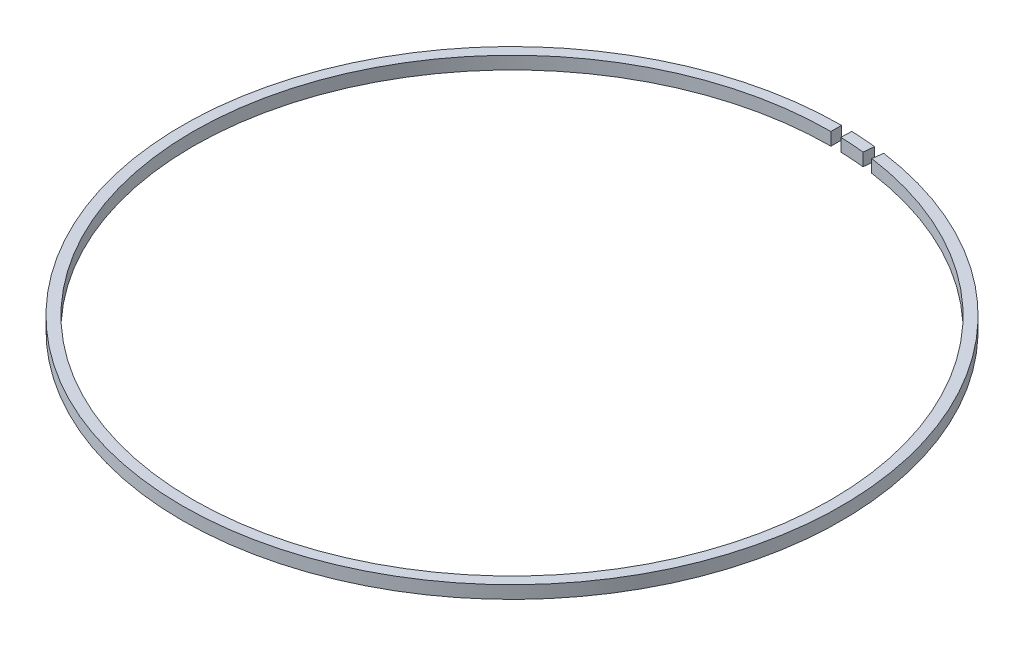
ISO-10303-21;
HEADER;
FILE_DESCRIPTION(('STEP AP214'),'2;1');
FILE_NAME('part.step','',(''),(''),'','','');
FILE_SCHEMA(('AUTOMOTIVE_DESIGN { 1 0 10303 214 1 1 1 1 }'));
ENDSEC;
DATA;
#1=APPLICATION_CONTEXT('core data for automotive mechanical design processes');
#2=APPLICATION_PROTOCOL_DEFINITION('international standard','automotive_design',2000,#1);
#3=PRODUCT_CONTEXT('',#1,'mechanical');
#4=PRODUCT('Part','Part','',(#3));
#5=PRODUCT_RELATED_PRODUCT_CATEGORY('part','',(#4));
#6=PRODUCT_DEFINITION_FORMATION('','',#4);
#7=PRODUCT_DEFINITION_CONTEXT('part definition',#1,'design');
#8=PRODUCT_DEFINITION('design','',#6,#7);
#9=PRODUCT_DEFINITION_SHAPE('','',#8);
#10=(LENGTH_UNIT() NAMED_UNIT(*) SI_UNIT(.MILLI.,.METRE.));
#11=(NAMED_UNIT(*) PLANE_ANGLE_UNIT() SI_UNIT($,.RADIAN.));
#12=(NAMED_UNIT(*) SI_UNIT($,.STERADIAN.) SOLID_ANGLE_UNIT());
#13=UNCERTAINTY_MEASURE_WITH_UNIT(LENGTH_MEASURE(1.E-05),#10,'distance_accuracy_value','');
#14=(GEOMETRIC_REPRESENTATION_CONTEXT(3) GLOBAL_UNCERTAINTY_ASSIGNED_CONTEXT((#13)) GLOBAL_UNIT_ASSIGNED_CONTEXT((#10,
#11,#12)) REPRESENTATION_CONTEXT('',''));
#15=CARTESIAN_POINT('',(0.,0.,0.));
#16=DIRECTION('',(0.,0.,1.));
#17=DIRECTION('',(1.,0.,0.));
#18=AXIS2_PLACEMENT_3D('',#15,#16,#17);
#19=CARTESIAN_POINT('',(0.,3.,0.));
#20=DIRECTION('',(0.,-1.,0.));
#21=DIRECTION('',(0.,0.,-1.));
#22=AXIS2_PLACEMENT_3D('',#19,#20,#21);
#23=CYLINDRICAL_SURFACE('',#22,77.5);
#24=CARTESIAN_POINT('',(0.,0.,0.));
#25=DIRECTION('',(0.,1.,0.));
#26=DIRECTION('',(0.,0.,1.));
#27=AXIS2_PLACEMENT_3D('',#24,#25,#26);
#28=CIRCLE('',#27,77.5);
#29=CARTESIAN_POINT('',(8.22728774385355,0.,-77.0620641845253));
#30=VERTEX_POINT('',#29);
#31=CARTESIAN_POINT('',(2.42944655623387,0.,-77.4619118627368));
#32=VERTEX_POINT('',#31);
#33=EDGE_CURVE('E97',#30,#32,#28,.T.);
#34=ORIENTED_EDGE('',*,*,#33,.T.);
#35=DIRECTION('',(0.,1.,0.));
#36=VECTOR('',#35,1.);
#37=CARTESIAN_POINT('',(2.42944655623387,0.,-77.4619118627368));
#38=LINE('',#37,#36);
#39=CARTESIAN_POINT('',(2.42944655623387,3.,-77.4619118627368));
#40=VERTEX_POINT('',#39);
#41=EDGE_CURVE('E105',#32,#40,#38,.T.);
#42=ORIENTED_EDGE('',*,*,#41,.T.);
#43=CARTESIAN_POINT('',(0.,3.,0.));
#44=DIRECTION('',(0.,1.,0.));
#45=DIRECTION('',(0.,0.,1.));
#46=AXIS2_PLACEMENT_3D('',#43,#44,#45);
#47=CIRCLE('',#46,77.5);
#48=CARTESIAN_POINT('',(8.22728774385352,3.,-77.0620641845251));
#49=VERTEX_POINT('',#48);
#50=EDGE_CURVE('E101',#49,#40,#47,.T.);
#51=ORIENTED_EDGE('',*,*,#50,.F.);
#52=DIRECTION('',(0.,1.,0.));
#53=VECTOR('',#52,1.);
#54=CARTESIAN_POINT('',(8.22728774385355,0.,-77.0620641845253));
#55=LINE('',#54,#53);
#56=EDGE_CURVE('E109',#30,#49,#55,.T.);
#57=ORIENTED_EDGE('',*,*,#56,.F.);
#58=EDGE_LOOP('',(#34,#42,#51,#57));
#59=FACE_BOUND('',#58,.T.);
#60=ADVANCED_FACE('F42',(#59),#23,.T.);
#61=CARTESIAN_POINT('',(0.,3.,0.));
#62=DIRECTION('',(0.,1.,0.));
#63=DIRECTION('',(0.,0.,1.));
#64=AXIS2_PLACEMENT_3D('',#61,#62,#63);
#65=PLANE('',#64);
#66=DIRECTION('',(0.0313476974997923,0.,-0.999508540164346));
#67=VECTOR('',#66,1.);
#68=CARTESIAN_POINT('',(2.42944655623388,3.,-77.4619118627368));
#69=LINE('',#68,#67);
#70=CARTESIAN_POINT('',(2.3510773124844,3.,-74.9631405123259));
#71=VERTEX_POINT('',#70);
#72=EDGE_CURVE('E46',#71,#40,#69,.T.);
#73=ORIENTED_EDGE('',*,*,#72,.F.);
#74=CARTESIAN_POINT('',(0.,3.,0.));
#75=DIRECTION('',(0.,1.,0.));
#76=DIRECTION('',(0.,0.,1.));
#77=AXIS2_PLACEMENT_3D('',#74,#75,#76);
#78=CIRCLE('',#77,75.);
#79=CARTESIAN_POINT('',(7.96189136501951,3.,-74.5761911463138));
#80=VERTEX_POINT('',#79);
#81=EDGE_CURVE('E88',#80,#71,#78,.T.);
#82=ORIENTED_EDGE('',*,*,#81,.F.);
#83=DIRECTION('',(-0.106158551533572,0.,0.994349215284195));
#84=VECTOR('',#83,1.);
#85=CARTESIAN_POINT('',(7.96189136501944,3.,-74.5761911463132));
#86=LINE('',#85,#84);
#87=EDGE_CURVE('E83',#49,#80,#86,.T.);
#88=ORIENTED_EDGE('',*,*,#87,.F.);
#89=ORIENTED_EDGE('',*,*,#50,.T.);
#90=EDGE_LOOP('',(#73,#82,#88,#89));
#91=FACE_BOUND('',#90,.T.);
#92=ADVANCED_FACE('F44',(#91),#65,.T.);
#93=CARTESIAN_POINT('',(0.,0.,0.));
#94=DIRECTION('',(0.,1.,0.));
#95=DIRECTION('',(0.,0.,1.));
#96=AXIS2_PLACEMENT_3D('',#93,#94,#95);
#97=PLANE('',#96);
#98=CARTESIAN_POINT('',(0.,0.,0.));
#99=DIRECTION('',(0.,1.,0.));
#100=DIRECTION('',(0.,0.,1.));
#101=AXIS2_PLACEMENT_3D('',#98,#99,#100);
#102=CIRCLE('',#101,75.);
#103=CARTESIAN_POINT('',(7.96189136501944,0.,-74.5761911463132));
#104=VERTEX_POINT('',#103);
#105=CARTESIAN_POINT('',(2.3510773124844,0.,-74.9631405123259));
#106=VERTEX_POINT('',#105);
#107=EDGE_CURVE('E95',#104,#106,#102,.T.);
#108=ORIENTED_EDGE('',*,*,#107,.T.);
#109=DIRECTION('',(0.0313476974997923,0.,-0.999508540164346));
#110=VECTOR('',#109,1.);
#111=CARTESIAN_POINT('',(2.42944655623388,0.,-77.4619118627368));
#112=LINE('',#111,#110);
#113=EDGE_CURVE('E98',#106,#32,#112,.T.);
#114=ORIENTED_EDGE('',*,*,#113,.T.);
#115=ORIENTED_EDGE('',*,*,#33,.F.);
#116=DIRECTION('',(-0.106158551533572,0.,0.994349215284195));
#117=VECTOR('',#116,1.);
#118=CARTESIAN_POINT('',(7.96189136501944,0.,-74.5761911463132));
#119=LINE('',#118,#117);
#120=EDGE_CURVE('E80',#30,#104,#119,.T.);
#121=ORIENTED_EDGE('',*,*,#120,.T.);
#122=EDGE_LOOP('',(#108,#114,#115,#121));
#123=FACE_BOUND('',#122,.T.);
#124=ADVANCED_FACE('F93',(#123),#97,.F.);
#125=CARTESIAN_POINT('',(0.,3.,0.));
#126=DIRECTION('',(0.,-1.,0.));
#127=DIRECTION('',(0.,0.,-1.));
#128=AXIS2_PLACEMENT_3D('',#125,#126,#127);
#129=CYLINDRICAL_SURFACE('',#128,75.);
#130=DIRECTION('',(0.,1.,0.));
#131=VECTOR('',#130,1.);
#132=CARTESIAN_POINT('',(2.3510773124844,0.,-74.9631405123259));
#133=LINE('',#132,#131);
#134=EDGE_CURVE('E12',#106,#71,#133,.T.);
#135=ORIENTED_EDGE('',*,*,#134,.F.);
#136=ORIENTED_EDGE('',*,*,#107,.F.);
#137=DIRECTION('',(0.,1.,0.));
#138=VECTOR('',#137,1.);
#139=CARTESIAN_POINT('',(7.96189136501944,0.,-74.5761911463132));
#140=LINE('',#139,#138);
#141=EDGE_CURVE('E77',#104,#80,#140,.T.);
#142=ORIENTED_EDGE('',*,*,#141,.T.);
#143=ORIENTED_EDGE('',*,*,#81,.T.);
#144=EDGE_LOOP('',(#135,#136,#142,#143));
#145=FACE_BOUND('',#144,.T.);
#146=ADVANCED_FACE('F100',(#145),#129,.F.);
#147=CARTESIAN_POINT('',(7.96189136501944,0.,-74.5761911463132));
#148=DIRECTION('',(-0.994349215284195,0.,-0.106158551533572));
#149=DIRECTION('',(-0.106158551533572,0.,0.994349215284195));
#150=AXIS2_PLACEMENT_3D('',#147,#148,#149);
#151=PLANE('',#150);
#152=ORIENTED_EDGE('',*,*,#87,.T.);
#153=ORIENTED_EDGE('',*,*,#141,.F.);
#154=ORIENTED_EDGE('',*,*,#120,.F.);
#155=ORIENTED_EDGE('',*,*,#56,.T.);
#156=EDGE_LOOP('',(#152,#153,#154,#155));
#157=FACE_BOUND('',#156,.T.);
#158=ADVANCED_FACE('F79',(#157),#151,.F.);
#159=CARTESIAN_POINT('',(2.42944655623388,0.,-77.4619118627368));
#160=DIRECTION('',(0.999508540164346,0.,0.0313476974997923));
#161=DIRECTION('',(0.0313476974997923,0.,-0.999508540164346));
#162=AXIS2_PLACEMENT_3D('',#159,#160,#161);
#163=PLANE('',#162);
#164=ORIENTED_EDGE('',*,*,#72,.T.);
#165=ORIENTED_EDGE('',*,*,#41,.F.);
#166=ORIENTED_EDGE('',*,*,#113,.F.);
#167=ORIENTED_EDGE('',*,*,#134,.T.);
#168=EDGE_LOOP('',(#164,#165,#166,#167));
#169=FACE_BOUND('',#168,.T.);
#170=ADVANCED_FACE('F116',(#169),#163,.F.);
#171=CLOSED_SHELL('',(#60,#92,#124,#146,#158,#170));
#172=MANIFOLD_SOLID_BREP('B2',#171);
#173=CARTESIAN_POINT('',(0.,3.,0.));
#174=DIRECTION('',(0.,-1.,0.));
#175=DIRECTION('',(0.,0.,-1.));
#176=AXIS2_PLACEMENT_3D('',#173,#174,#175);
#177=CYLINDRICAL_SURFACE('',#176,75.);
#178=DIRECTION('',(0.,1.,0.));
#179=VECTOR('',#178,1.);
#180=CARTESIAN_POINT('',(0.,0.,-75.));
#181=LINE('',#180,#179);
#182=CARTESIAN_POINT('',(0.,0.,-75.));
#183=VERTEX_POINT('',#182);
#184=CARTESIAN_POINT('',(0.,3.,-75.));
#185=VERTEX_POINT('',#184);
#186=EDGE_CURVE('E213',#183,#185,#181,.T.);
#187=ORIENTED_EDGE('',*,*,#186,.T.);
#188=CARTESIAN_POINT('',(0.,3.,0.));
#189=DIRECTION('',(0.,1.,0.));
#190=DIRECTION('',(0.,0.,1.));
#191=AXIS2_PLACEMENT_3D('',#188,#189,#190);
#192=CIRCLE('',#191,75.);
#193=CARTESIAN_POINT('',(10.3047555557651,3.,-74.2887071696363));
#194=VERTEX_POINT('',#193);
#195=EDGE_CURVE('E220',#185,#194,#192,.T.);
#196=ORIENTED_EDGE('',*,*,#195,.T.);
#197=DIRECTION('',(0.,1.,0.));
#198=VECTOR('',#197,1.);
#199=CARTESIAN_POINT('',(10.3047555557652,0.,-74.2887071696366));
#200=LINE('',#199,#198);
#201=CARTESIAN_POINT('',(10.3047555557651,0.,-74.288707169636));
#202=VERTEX_POINT('',#201);
#203=EDGE_CURVE('E225',#202,#194,#200,.T.);
#204=ORIENTED_EDGE('',*,*,#203,.F.);
#205=CARTESIAN_POINT('',(0.,0.,0.));
#206=DIRECTION('',(0.,1.,0.));
#207=DIRECTION('',(0.,0.,1.));
#208=AXIS2_PLACEMENT_3D('',#205,#206,#207);
#209=CIRCLE('',#208,75.);
#210=EDGE_CURVE('E221',#183,#202,#209,.T.);
#211=ORIENTED_EDGE('',*,*,#210,.F.);
#212=EDGE_LOOP('',(#187,#196,#204,#211));
#213=FACE_BOUND('',#212,.T.);
#214=ADVANCED_FACE('F166',(#213),#177,.F.);
#215=CARTESIAN_POINT('',(0.,3.,0.));
#216=DIRECTION('',(0.,-1.,0.));
#217=DIRECTION('',(0.,0.,-1.));
#218=AXIS2_PLACEMENT_3D('',#215,#216,#217);
#219=CYLINDRICAL_SURFACE('',#218,77.5);
#220=CARTESIAN_POINT('',(0.,3.,0.));
#221=DIRECTION('',(0.,1.,0.));
#222=DIRECTION('',(0.,0.,1.));
#223=AXIS2_PLACEMENT_3D('',#220,#221,#222);
#224=CIRCLE('',#223,77.5);
#225=CARTESIAN_POINT('',(0.,3.,-77.5));
#226=VERTEX_POINT('',#225);
#227=CARTESIAN_POINT('',(10.6482530249527,3.,-76.7649966294288));
#228=VERTEX_POINT('',#227);
#229=EDGE_CURVE('E40',#226,#228,#224,.T.);
#230=ORIENTED_EDGE('',*,*,#229,.F.);
#231=DIRECTION('',(0.,1.,0.));
#232=VECTOR('',#231,1.);
#233=CARTESIAN_POINT('',(0.,0.,-77.5));
#234=LINE('',#233,#232);
#235=CARTESIAN_POINT('',(0.,0.,-77.5));
#236=VERTEX_POINT('',#235);
#237=EDGE_CURVE('E201',#236,#226,#234,.T.);
#238=ORIENTED_EDGE('',*,*,#237,.F.);
#239=CARTESIAN_POINT('',(0.,0.,0.));
#240=DIRECTION('',(0.,1.,0.));
#241=DIRECTION('',(0.,0.,1.));
#242=AXIS2_PLACEMENT_3D('',#239,#240,#241);
#243=CIRCLE('',#242,77.5);
#244=CARTESIAN_POINT('',(10.6482530249523,0.,-76.7649966294264));
#245=VERTEX_POINT('',#244);
#246=EDGE_CURVE('E176',#236,#245,#243,.T.);
#247=ORIENTED_EDGE('',*,*,#246,.T.);
#248=DIRECTION('',(0.,1.,0.));
#249=VECTOR('',#248,1.);
#250=CARTESIAN_POINT('',(10.6482530249523,0.,-76.7649966294264));
#251=LINE('',#250,#249);
#252=EDGE_CURVE('E224',#245,#228,#251,.T.);
#253=ORIENTED_EDGE('',*,*,#252,.T.);
#254=EDGE_LOOP('',(#230,#238,#247,#253));
#255=FACE_BOUND('',#254,.T.);
#256=ADVANCED_FACE('F168',(#255),#219,.T.);
#257=CARTESIAN_POINT('',(0.,0.,0.));
#258=DIRECTION('',(0.,1.,0.));
#259=DIRECTION('',(0.,0.,1.));
#260=AXIS2_PLACEMENT_3D('',#257,#258,#259);
#261=PLANE('',#260);
#262=ORIENTED_EDGE('',*,*,#246,.F.);
#263=DIRECTION('',(0.,0.,1.));
#264=VECTOR('',#263,1.);
#265=CARTESIAN_POINT('',(0.,0.,-75.));
#266=LINE('',#265,#264);
#267=EDGE_CURVE('E208',#236,#183,#266,.T.);
#268=ORIENTED_EDGE('',*,*,#267,.T.);
#269=ORIENTED_EDGE('',*,*,#210,.T.);
#270=DIRECTION('',(0.137398987674824,0.,-0.990515783915599));
#271=VECTOR('',#270,1.);
#272=CARTESIAN_POINT('',(10.6482530249528,0.,-76.7649966294299));
#273=LINE('',#272,#271);
#274=EDGE_CURVE('E184',#202,#245,#273,.T.);
#275=ORIENTED_EDGE('',*,*,#274,.T.);
#276=EDGE_LOOP('',(#262,#268,#269,#275));
#277=FACE_BOUND('',#276,.T.);
#278=ADVANCED_FACE('F238',(#277),#261,.F.);
#279=CARTESIAN_POINT('',(0.,3.,0.));
#280=DIRECTION('',(0.,1.,0.));
#281=DIRECTION('',(0.,0.,1.));
#282=AXIS2_PLACEMENT_3D('',#279,#280,#281);
#283=PLANE('',#282);
#284=DIRECTION('',(0.,0.,1.));
#285=VECTOR('',#284,1.);
#286=CARTESIAN_POINT('',(0.,3.,-75.));
#287=LINE('',#286,#285);
#288=EDGE_CURVE('E170',#226,#185,#287,.T.);
#289=ORIENTED_EDGE('',*,*,#288,.F.);
#290=ORIENTED_EDGE('',*,*,#229,.T.);
#291=DIRECTION('',(0.137398987674824,0.,-0.990515783915599));
#292=VECTOR('',#291,1.);
#293=CARTESIAN_POINT('',(10.6482530249528,3.,-76.7649966294299));
#294=LINE('',#293,#292);
#295=EDGE_CURVE('E222',#194,#228,#294,.T.);
#296=ORIENTED_EDGE('',*,*,#295,.F.);
#297=ORIENTED_EDGE('',*,*,#195,.F.);
#298=EDGE_LOOP('',(#289,#290,#296,#297));
#299=FACE_BOUND('',#298,.T.);
#300=ADVANCED_FACE('F217',(#299),#283,.T.);
#301=CARTESIAN_POINT('',(10.6482530249528,0.,-76.7649966294299));
#302=DIRECTION('',(0.990515783915599,0.,0.137398987674824));
#303=DIRECTION('',(0.137398987674824,0.,-0.990515783915599));
#304=AXIS2_PLACEMENT_3D('',#301,#302,#303);
#305=PLANE('',#304);
#306=ORIENTED_EDGE('',*,*,#295,.T.);
#307=ORIENTED_EDGE('',*,*,#252,.F.);
#308=ORIENTED_EDGE('',*,*,#274,.F.);
#309=ORIENTED_EDGE('',*,*,#203,.T.);
#310=EDGE_LOOP('',(#306,#307,#308,#309));
#311=FACE_BOUND('',#310,.T.);
#312=ADVANCED_FACE('F240',(#311),#305,.F.);
#313=CARTESIAN_POINT('',(0.,0.,-75.));
#314=DIRECTION('',(-1.,0.,0.));
#315=DIRECTION('',(0.,0.,1.));
#316=AXIS2_PLACEMENT_3D('',#313,#314,#315);
#317=PLANE('',#316);
#318=ORIENTED_EDGE('',*,*,#288,.T.);
#319=ORIENTED_EDGE('',*,*,#186,.F.);
#320=ORIENTED_EDGE('',*,*,#267,.F.);
#321=ORIENTED_EDGE('',*,*,#237,.T.);
#322=EDGE_LOOP('',(#318,#319,#320,#321));
#323=FACE_BOUND('',#322,.T.);
#324=ADVANCED_FACE('F203',(#323),#317,.F.);
#325=CLOSED_SHELL('',(#214,#256,#278,#300,#312,#324));
#326=MANIFOLD_SOLID_BREP('B6',#325);
#327=ADVANCED_BREP_SHAPE_REPRESENTATION('',(#18,#172,#326),#14);
#328=SHAPE_DEFINITION_REPRESENTATION(#9,#327);
ENDSEC;
END-ISO-10303-21;
